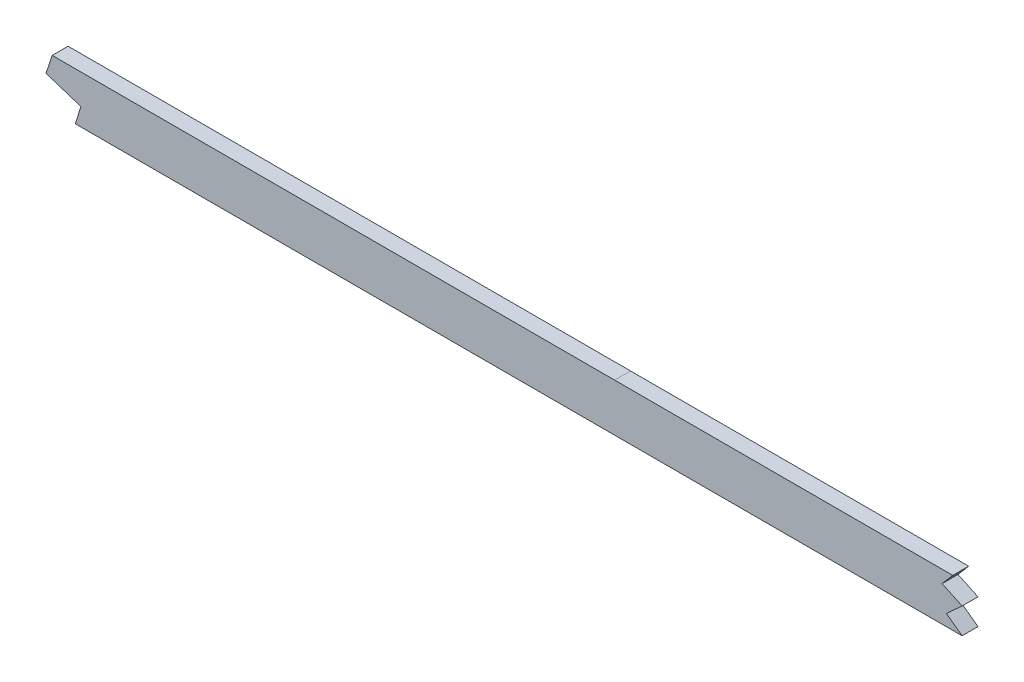
ISO-10303-21;
HEADER;
FILE_DESCRIPTION(('STEP AP214'),'2;1');
FILE_NAME('part.step','',(''),(''),'','','');
FILE_SCHEMA(('AUTOMOTIVE_DESIGN { 1 0 10303 214 1 1 1 1 }'));
ENDSEC;
DATA;
#1=APPLICATION_CONTEXT('core data for automotive mechanical design processes');
#2=APPLICATION_PROTOCOL_DEFINITION('international standard','automotive_design',2000,#1);
#3=PRODUCT_CONTEXT('',#1,'mechanical');
#4=PRODUCT('Part','Part','',(#3));
#5=PRODUCT_RELATED_PRODUCT_CATEGORY('part','',(#4));
#6=PRODUCT_DEFINITION_FORMATION('','',#4);
#7=PRODUCT_DEFINITION_CONTEXT('part definition',#1,'design');
#8=PRODUCT_DEFINITION('design','',#6,#7);
#9=PRODUCT_DEFINITION_SHAPE('','',#8);
#10=(LENGTH_UNIT() NAMED_UNIT(*) SI_UNIT(.MILLI.,.METRE.));
#11=(NAMED_UNIT(*) PLANE_ANGLE_UNIT() SI_UNIT($,.RADIAN.));
#12=(NAMED_UNIT(*) SI_UNIT($,.STERADIAN.) SOLID_ANGLE_UNIT());
#13=UNCERTAINTY_MEASURE_WITH_UNIT(LENGTH_MEASURE(1.E-05),#10,'distance_accuracy_value','');
#14=(GEOMETRIC_REPRESENTATION_CONTEXT(3) GLOBAL_UNCERTAINTY_ASSIGNED_CONTEXT((#13)) GLOBAL_UNIT_ASSIGNED_CONTEXT((#10,
#11,#12)) REPRESENTATION_CONTEXT('',''));
#15=CARTESIAN_POINT('',(0.,0.,0.));
#16=DIRECTION('',(0.,0.,1.));
#17=DIRECTION('',(1.,0.,0.));
#18=AXIS2_PLACEMENT_3D('',#15,#16,#17);
#19=CARTESIAN_POINT('',(2698.48667469404,11.4806601503293,3.175));
#20=CARTESIAN_POINT('',(2691.24737670604,10.9833200828121,3.175));
#21=CARTESIAN_POINT('',(2679.19516047804,10.1655376868452,3.175));
#22=CARTESIAN_POINT('',(2662.27652557768,9.03876140898899,3.175));
#23=CARTESIAN_POINT('',(2635.66628230206,7.2924691456857,3.175));
#24=CARTESIAN_POINT('',(2596.85766552893,4.8260568530791,3.175));
#25=CARTESIAN_POINT('',(2545.72974303923,1.75834409257586,3.175));
#26=CARTESIAN_POINT('',(2494.40530570724,-1.09855523520035,3.175));
#27=CARTESIAN_POINT('',(2451.53302226734,-3.26657329681936,3.175));
#28=CARTESIAN_POINT('',(2417.1983167563,-4.86708361008882,3.175));
#29=CARTESIAN_POINT('',(2391.45707691927,-6.00358923536048,3.175));
#30=CARTESIAN_POINT('',(2365.63473630713,-7.08685458139135,3.175));
#31=CARTESIAN_POINT('',(2339.54628467245,-8.13772994402807,3.175));
#32=CARTESIAN_POINT('',(2313.46613297408,-9.16513837136649,3.175));
#33=CARTESIAN_POINT('',(2287.61237548634,-10.1794782148021,3.175));
#34=CARTESIAN_POINT('',(2261.7633474368,-11.2010322967668,3.175));
#35=CARTESIAN_POINT('',(2227.28532971514,-12.5838425566113,3.175));
#36=CARTESIAN_POINT('',(2184.17556939327,-14.3660723604172,3.175));
#37=CARTESIAN_POINT('',(2132.42906611447,-16.6074278682384,3.175));
#38=CARTESIAN_POINT('',(2063.42552339989,-19.708920484548,3.175));
#39=CARTESIAN_POINT('',(1977.17490763451,-23.7005433130483,3.175));
#40=CARTESIAN_POINT('',(1873.73245143151,-28.149389220677,3.175));
#41=CARTESIAN_POINT('',(1770.37461881016,-31.6574686487852,3.175));
#42=CARTESIAN_POINT('',(1667.08568781321,-33.7931175563218,3.175));
#43=CARTESIAN_POINT('',(1581.01109449057,-34.3831888311612,3.175));
#44=CARTESIAN_POINT('',(1512.07397125959,-34.4278026003723,3.175));
#45=CARTESIAN_POINT('',(1443.06151347714,-34.4095104024296,3.175));
#46=CARTESIAN_POINT('',(1356.80092787913,-34.4244328117572,3.175));
#47=CARTESIAN_POINT('',(1218.79462695393,-34.4184647879491,3.175));
#48=CARTESIAN_POINT('',(1115.28902278569,-34.4207027968771,3.175));
#49=CARTESIAN_POINT('',(1046.28548189005,-34.4207027968771,3.175));
#50=B_SPLINE_CURVE_WITH_KNOTS('',3,(#19,#20,#21,#22,#23,#24,#25,#26,#27,#28,#29,#30,#31,#32,#33,
#34,#35,#36,#37,#38,#39,#40,#41,#42,#43,#44,#45,#46,#47,#48,#49),.UNSPECIFIED.,.F.,.F.,(4,1,1,1,
1,1,1,1,1,1,1,1,1,1,1,1,1,1,1,1,1,1,1,1,1,1,1,1,4),(100.654804519159,102.842388131745,
104.300777206802,105.766098402935,110.877392286712,115.988686170488,121.099980054264,
126.21127393804,128.766920879929,131.322567821817,133.878214763705,136.433861705593,
138.989508647481,141.545155589369,144.100802531257,146.656449473146,151.767743356922,
156.879037240698,161.990331124474,172.212918892027,182.43550665958,192.658094427132,
202.880682194685,213.103269962237,218.214563846014,223.32585772979,233.548445497342,
243.771033264895,264.2162088),.UNSPECIFIED.);
#51=DIRECTION('',(0.,0.,-1.));
#52=VECTOR('',#51,1.);
#53=SURFACE_OF_LINEAR_EXTRUSION('',#50,#52);
#54=CARTESIAN_POINT('',(1181.43398343302,-34.4200405248928,3.175));
#55=VERTEX_POINT('',#54);
#56=CARTESIAN_POINT('',(1046.28548189005,-34.4207027968771,3.175));
#57=VERTEX_POINT('',#56);
#58=EDGE_CURVE('E42',#55,#57,#50,.T.);
#59=ORIENTED_EDGE('',*,*,#58,.F.);
#60=DIRECTION('',(0.,0.,1.));
#61=VECTOR('',#60,1.);
#62=CARTESIAN_POINT('',(1181.43398343302,-34.4200405248928,-4.445));
#63=LINE('',#62,#61);
#64=CARTESIAN_POINT('',(1181.43398343302,-34.4200405248928,-3.175));
#65=VERTEX_POINT('',#64);
#66=EDGE_CURVE('E161',#65,#55,#63,.T.);
#67=ORIENTED_EDGE('',*,*,#66,.F.);
#68=CARTESIAN_POINT('',(2698.48667469404,11.4806601503293,-3.175));
#69=CARTESIAN_POINT('',(2691.24737670604,10.9833200828121,-3.175));
#70=CARTESIAN_POINT('',(2679.19516047804,10.1655376868452,-3.175));
#71=CARTESIAN_POINT('',(2662.27652557768,9.03876140898899,-3.175));
#72=CARTESIAN_POINT('',(2635.66628230206,7.2924691456857,-3.175));
#73=CARTESIAN_POINT('',(2596.85766552893,4.8260568530791,-3.175));
#74=CARTESIAN_POINT('',(2545.72974303923,1.75834409257586,-3.175));
#75=CARTESIAN_POINT('',(2494.40530570724,-1.09855523520035,-3.175));
#76=CARTESIAN_POINT('',(2451.53302226734,-3.26657329681936,-3.175));
#77=CARTESIAN_POINT('',(2417.1983167563,-4.86708361008882,-3.175));
#78=CARTESIAN_POINT('',(2391.45707691927,-6.00358923536048,-3.175));
#79=CARTESIAN_POINT('',(2365.63473630713,-7.08685458139135,-3.175));
#80=CARTESIAN_POINT('',(2339.54628467245,-8.13772994402807,-3.175));
#81=CARTESIAN_POINT('',(2313.46613297408,-9.16513837136649,-3.175));
#82=CARTESIAN_POINT('',(2287.61237548634,-10.1794782148021,-3.175));
#83=CARTESIAN_POINT('',(2261.7633474368,-11.2010322967668,-3.175));
#84=CARTESIAN_POINT('',(2227.28532971514,-12.5838425566113,-3.175));
#85=CARTESIAN_POINT('',(2184.17556939327,-14.3660723604172,-3.175));
#86=CARTESIAN_POINT('',(2132.42906611447,-16.6074278682384,-3.175));
#87=CARTESIAN_POINT('',(2063.42552339989,-19.708920484548,-3.175));
#88=CARTESIAN_POINT('',(1977.17490763451,-23.7005433130483,-3.175));
#89=CARTESIAN_POINT('',(1873.73245143151,-28.149389220677,-3.175));
#90=CARTESIAN_POINT('',(1770.37461881016,-31.6574686487852,-3.175));
#91=CARTESIAN_POINT('',(1667.08568781321,-33.7931175563218,-3.175));
#92=CARTESIAN_POINT('',(1581.01109449057,-34.3831888311612,-3.175));
#93=CARTESIAN_POINT('',(1512.07397125959,-34.4278026003723,-3.175));
#94=CARTESIAN_POINT('',(1443.06151347714,-34.4095104024296,-3.175));
#95=CARTESIAN_POINT('',(1356.80092787913,-34.4244328117572,-3.175));
#96=CARTESIAN_POINT('',(1218.79462695393,-34.4184647879491,-3.175));
#97=CARTESIAN_POINT('',(1115.28902278569,-34.4207027968771,-3.175));
#98=CARTESIAN_POINT('',(1046.28548189005,-34.4207027968771,-3.175));
#99=B_SPLINE_CURVE_WITH_KNOTS('',3,(#68,#69,#70,#71,#72,#73,#74,#75,#76,#77,#78,#79,#80,#81,#82,
#83,#84,#85,#86,#87,#88,#89,#90,#91,#92,#93,#94,#95,#96,#97,#98),.UNSPECIFIED.,.F.,.F.,(4,1,1,1,
1,1,1,1,1,1,1,1,1,1,1,1,1,1,1,1,1,1,1,1,1,1,1,1,4),(100.654804519159,102.842388131745,
104.300777206802,105.766098402935,110.877392286712,115.988686170488,121.099980054264,
126.21127393804,128.766920879929,131.322567821817,133.878214763705,136.433861705593,
138.989508647481,141.545155589369,144.100802531257,146.656449473146,151.767743356922,
156.879037240698,161.990331124474,172.212918892027,182.43550665958,192.658094427132,
202.880682194685,213.103269962237,218.214563846014,223.32585772979,233.548445497342,
243.771033264895,264.2162088),.UNSPECIFIED.);
#100=CARTESIAN_POINT('',(1046.28548189005,-34.4207027968771,-3.175));
#101=VERTEX_POINT('',#100);
#102=EDGE_CURVE('E158',#65,#101,#99,.T.);
#103=ORIENTED_EDGE('',*,*,#102,.T.);
#104=DIRECTION('',(0.,0.,-1.));
#105=VECTOR('',#104,1.);
#106=CARTESIAN_POINT('',(1046.28548189005,-34.4207027968771,3.175));
#107=LINE('',#106,#105);
#108=EDGE_CURVE('E270',#57,#101,#107,.T.);
#109=ORIENTED_EDGE('',*,*,#108,.F.);
#110=EDGE_LOOP('',(#59,#67,#103,#109));
#111=FACE_BOUND('',#110,.T.);
#112=ADVANCED_FACE('F38',(#111),#53,.F.);
#113=CARTESIAN_POINT('',(0.,-53.4707027968771,3.175));
#114=DIRECTION('',(0.,-1.,0.));
#115=DIRECTION('',(0.,0.,-1.));
#116=AXIS2_PLACEMENT_3D('',#113,#114,#115);
#117=PLANE('',#116);
#118=DIRECTION('',(0.,0.,1.));
#119=VECTOR('',#118,1.);
#120=CARTESIAN_POINT('',(830.756310041553,-53.4707027968771,-4.445));
#121=LINE('',#120,#119);
#122=CARTESIAN_POINT('',(830.756310041553,-53.4707027968771,-3.175));
#123=VERTEX_POINT('',#122);
#124=CARTESIAN_POINT('',(830.756310041553,-53.4707027968771,3.175));
#125=VERTEX_POINT('',#124);
#126=EDGE_CURVE('E122',#123,#125,#121,.T.);
#127=ORIENTED_EDGE('',*,*,#126,.F.);
#128=DIRECTION('',(-1.,0.,0.));
#129=VECTOR('',#128,1.);
#130=CARTESIAN_POINT('',(0.,-53.4707027968771,-3.175));
#131=LINE('',#130,#129);
#132=CARTESIAN_POINT('',(1046.28548189005,-53.4707027968771,-3.175));
#133=VERTEX_POINT('',#132);
#134=EDGE_CURVE('E232',#133,#123,#131,.T.);
#135=ORIENTED_EDGE('',*,*,#134,.F.);
#136=DIRECTION('',(0.,0.,-1.));
#137=VECTOR('',#136,1.);
#138=CARTESIAN_POINT('',(1046.28548189005,-53.4707027968771,3.175));
#139=LINE('',#138,#137);
#140=CARTESIAN_POINT('',(1046.28548189005,-53.4707027968771,3.175));
#141=VERTEX_POINT('',#140);
#142=EDGE_CURVE('E149',#141,#133,#139,.T.);
#143=ORIENTED_EDGE('',*,*,#142,.F.);
#144=DIRECTION('',(-1.,0.,0.));
#145=VECTOR('',#144,1.);
#146=CARTESIAN_POINT('',(0.,-53.4707027968771,3.175));
#147=LINE('',#146,#145);
#148=EDGE_CURVE('E141',#141,#125,#147,.T.);
#149=ORIENTED_EDGE('',*,*,#148,.T.);
#150=EDGE_LOOP('',(#127,#135,#143,#149));
#151=FACE_BOUND('',#150,.T.);
#152=ADVANCED_FACE('F40',(#151),#117,.T.);
#153=CARTESIAN_POINT('',(2699.79233294449,-7.52454325644929,3.175));
#154=CARTESIAN_POINT('',(2639.63682069028,-11.6572294058032,3.175));
#155=CARTESIAN_POINT('',(2579.48130742255,-15.435846921513,3.175));
#156=CARTESIAN_POINT('',(2518.49810546626,-19.1485286488731,3.175));
#157=CARTESIAN_POINT('',(2436.3555443117,-23.2523639114786,3.175));
#158=CARTESIAN_POINT('',(2354.21298315715,-26.6314864233564,3.175));
#159=CARTESIAN_POINT('',(2332.5703304682,-27.4809881692809,3.175));
#160=CARTESIAN_POINT('',(2156.26863942885,-34.3777685431634,3.175));
#161=CARTESIAN_POINT('',(1979.96694737597,-41.6286312484567,3.175));
#162=CARTESIAN_POINT('',(1824.11427763497,-52.7712658766203,3.175));
#163=CARTESIAN_POINT('',(1636.92860677809,-53.5795698486924,3.175));
#164=CARTESIAN_POINT('',(1449.7429359212,-53.4540246131279,3.175));
#165=CARTESIAN_POINT('',(1418.00673093479,-53.4707027968771,3.175));
#166=CARTESIAN_POINT('',(1324.89933614602,-53.4707027968771,3.175));
#167=CARTESIAN_POINT('',(1231.79194034372,-53.4707027968771,3.175));
#168=CARTESIAN_POINT('',(1170.4412693194,-53.4707027968771,3.175));
#169=CARTESIAN_POINT('',(1108.78407581299,-53.4707027968771,3.175));
#170=CARTESIAN_POINT('',(1047.12688234629,-53.4707027968771,3.175));
#171=CARTESIAN_POINT('',(1046.84641418849,-53.4707027968771,3.175));
#172=CARTESIAN_POINT('',(1046.56594718406,-53.4707027968771,3.175));
#173=CARTESIAN_POINT('',(1046.28548189005,-53.4707027968771,3.175));
#174=(BOUNDED_CURVE() B_SPLINE_CURVE(5,(#153,#154,#155,#156,#157,#158,#159,#160,#161,#162,#163,
#164,#165,#166,#167,#168,#169,#170,#171,#172,#173),.UNSPECIFIED.,.F.,
.F.) B_SPLINE_CURVE_WITH_KNOTS((6,3,3,3,3,3,6),(100.654804519159,130.927896619159,
141.337054719159,218.101815019159,233.772059419159,264.077723219159,264.2162088),
.UNSPECIFIED.) CURVE() GEOMETRIC_REPRESENTATION_ITEM() RATIONAL_B_SPLINE_CURVE((1.,1.,1.,1.,1.,
1.,1.,1.,1.,1.,1.,1.,1.,1.,1.,1.,1.,1.,1.,1.,1.)) REPRESENTATION_ITEM(''));
#175=DIRECTION('',(0.,0.,-1.));
#176=VECTOR('',#175,1.);
#177=SURFACE_OF_LINEAR_EXTRUSION('',#174,#176);
#178=DIRECTION('',(0.,0.,1.));
#179=VECTOR('',#178,1.);
#180=CARTESIAN_POINT('',(1185.13596806479,-53.4707027968771,-4.445));
#181=LINE('',#180,#179);
#182=CARTESIAN_POINT('',(1185.13596806479,-53.4707027968771,-3.175));
#183=VERTEX_POINT('',#182);
#184=CARTESIAN_POINT('',(1185.13596806479,-53.4707027968771,3.175));
#185=VERTEX_POINT('',#184);
#186=EDGE_CURVE('E145',#183,#185,#181,.T.);
#187=ORIENTED_EDGE('',*,*,#186,.T.);
#188=EDGE_CURVE('E151',#185,#141,#174,.T.);
#189=ORIENTED_EDGE('',*,*,#188,.T.);
#190=ORIENTED_EDGE('',*,*,#142,.T.);
#191=CARTESIAN_POINT('',(2699.79233294449,-7.52454325644929,-3.175));
#192=CARTESIAN_POINT('',(2639.63682069028,-11.6572294058032,-3.175));
#193=CARTESIAN_POINT('',(2579.48130742255,-15.435846921513,-3.175));
#194=CARTESIAN_POINT('',(2518.49810546626,-19.1485286488731,-3.175));
#195=CARTESIAN_POINT('',(2436.3555443117,-23.2523639114786,-3.175));
#196=CARTESIAN_POINT('',(2354.21298315715,-26.6314864233564,-3.175));
#197=CARTESIAN_POINT('',(2332.5703304682,-27.4809881692809,-3.175));
#198=CARTESIAN_POINT('',(2156.26863942885,-34.3777685431634,-3.175));
#199=CARTESIAN_POINT('',(1979.96694737597,-41.6286312484567,-3.175));
#200=CARTESIAN_POINT('',(1824.11427763497,-52.7712658766203,-3.175));
#201=CARTESIAN_POINT('',(1636.92860677809,-53.5795698486924,-3.175));
#202=CARTESIAN_POINT('',(1449.7429359212,-53.4540246131279,-3.175));
#203=CARTESIAN_POINT('',(1418.00673093479,-53.4707027968771,-3.175));
#204=CARTESIAN_POINT('',(1324.89933614602,-53.4707027968771,-3.175));
#205=CARTESIAN_POINT('',(1231.79194034372,-53.4707027968771,-3.175));
#206=CARTESIAN_POINT('',(1170.4412693194,-53.4707027968771,-3.175));
#207=CARTESIAN_POINT('',(1108.78407581299,-53.4707027968771,-3.175));
#208=CARTESIAN_POINT('',(1047.12688234629,-53.4707027968771,-3.175));
#209=CARTESIAN_POINT('',(1046.84641418849,-53.4707027968771,-3.175));
#210=CARTESIAN_POINT('',(1046.56594718406,-53.4707027968771,-3.175));
#211=CARTESIAN_POINT('',(1046.28548189005,-53.4707027968771,-3.175));
#212=(BOUNDED_CURVE() B_SPLINE_CURVE(5,(#191,#192,#193,#194,#195,#196,#197,#198,#199,#200,#201,
#202,#203,#204,#205,#206,#207,#208,#209,#210,#211),.UNSPECIFIED.,.F.,
.F.) B_SPLINE_CURVE_WITH_KNOTS((6,3,3,3,3,3,6),(100.654804519159,130.927896619159,
141.337054719159,218.101815019159,233.772059419159,264.077723219159,264.2162088),
.UNSPECIFIED.) CURVE() GEOMETRIC_REPRESENTATION_ITEM() RATIONAL_B_SPLINE_CURVE((1.,1.,1.,1.,1.,
1.,1.,1.,1.,1.,1.,1.,1.,1.,1.,1.,1.,1.,1.,1.,1.)) REPRESENTATION_ITEM(''));
#213=EDGE_CURVE('E278',#183,#133,#212,.T.);
#214=ORIENTED_EDGE('',*,*,#213,.F.);
#215=EDGE_LOOP('',(#187,#189,#190,#214));
#216=FACE_BOUND('',#215,.T.);
#217=ADVANCED_FACE('F173',(#216),#177,.T.);
#218=CARTESIAN_POINT('',(0.,-34.4207027968772,3.175));
#219=DIRECTION('',(0.,-1.,0.));
#220=DIRECTION('',(1.,0.,0.));
#221=AXIS2_PLACEMENT_3D('',#218,#219,#220);
#222=PLANE('',#221);
#223=DIRECTION('',(-1.,0.,0.));
#224=VECTOR('',#223,1.);
#225=CARTESIAN_POINT('',(0.,-34.4207027968772,-3.175));
#226=LINE('',#225,#224);
#227=CARTESIAN_POINT('',(821.518882755119,-34.4207027968771,-3.175));
#228=VERTEX_POINT('',#227);
#229=EDGE_CURVE('E152',#101,#228,#226,.T.);
#230=ORIENTED_EDGE('',*,*,#229,.T.);
#231=DIRECTION('',(0.,0.,1.));
#232=VECTOR('',#231,1.);
#233=CARTESIAN_POINT('',(821.518882755119,-34.4207027968771,-4.445));
#234=LINE('',#233,#232);
#235=CARTESIAN_POINT('',(821.518882755119,-34.4207027968771,3.175));
#236=VERTEX_POINT('',#235);
#237=EDGE_CURVE('E221',#228,#236,#234,.T.);
#238=ORIENTED_EDGE('',*,*,#237,.T.);
#239=DIRECTION('',(-1.,0.,0.));
#240=VECTOR('',#239,1.);
#241=CARTESIAN_POINT('',(0.,-34.4207027968772,3.175));
#242=LINE('',#241,#240);
#243=EDGE_CURVE('E227',#57,#236,#242,.T.);
#244=ORIENTED_EDGE('',*,*,#243,.F.);
#245=ORIENTED_EDGE('',*,*,#108,.T.);
#246=EDGE_LOOP('',(#230,#238,#244,#245));
#247=FACE_BOUND('',#246,.T.);
#248=ADVANCED_FACE('F176',(#247),#222,.F.);
#249=CARTESIAN_POINT('',(0.,0.,3.175));
#250=DIRECTION('',(0.,0.,1.));
#251=DIRECTION('',(1.,0.,0.));
#252=AXIS2_PLACEMENT_3D('',#249,#250,#251);
#253=PLANE('',#252);
#254=DIRECTION('',(0.314735447377986,0.949179434123906,0.));
#255=VECTOR('',#254,1.);
#256=CARTESIAN_POINT('',(821.518882755119,-34.4207027968771,3.175));
#257=LINE('',#256,#255);
#258=CARTESIAN_POINT('',(819.047328197418,-41.8744191673383,3.175));
#259=VERTEX_POINT('',#258);
#260=EDGE_CURVE('E134',#259,#236,#257,.T.);
#261=ORIENTED_EDGE('',*,*,#260,.F.);
#262=DIRECTION('',(-0.951561635426516,0.30745805239807,0.));
#263=VECTOR('',#262,1.);
#264=CARTESIAN_POINT('',(819.047328197418,-41.8744191673383,3.175));
#265=LINE('',#264,#263);
#266=CARTESIAN_POINT('',(833.004793215906,-46.3842006163091,3.175));
#267=VERTEX_POINT('',#266);
#268=EDGE_CURVE('E143',#267,#259,#265,.T.);
#269=ORIENTED_EDGE('',*,*,#268,.F.);
#270=DIRECTION('',(0.302432493069435,0.953170806904936,0.));
#271=VECTOR('',#270,1.);
#272=CARTESIAN_POINT('',(833.004793215906,-46.3842006163091,3.175));
#273=LINE('',#272,#271);
#274=EDGE_CURVE('E125',#125,#267,#273,.T.);
#275=ORIENTED_EDGE('',*,*,#274,.F.);
#276=ORIENTED_EDGE('',*,*,#148,.F.);
#277=ORIENTED_EDGE('',*,*,#188,.F.);
#278=DIRECTION('',(0.807160024463634,-0.59033269849117,0.));
#279=VECTOR('',#278,1.);
#280=CARTESIAN_POINT('',(1178.85783852763,-48.8790666419403,3.175));
#281=LINE('',#280,#279);
#282=CARTESIAN_POINT('',(1178.85783852763,-48.8790666419403,3.175));
#283=VERTEX_POINT('',#282);
#284=EDGE_CURVE('E247',#283,#185,#281,.T.);
#285=ORIENTED_EDGE('',*,*,#284,.F.);
#286=DIRECTION('',(-0.73933586722595,-0.673336821682323,0.));
#287=VECTOR('',#286,1.);
#288=CARTESIAN_POINT('',(1185.13596806479,-43.1613732686698,3.175));
#289=LINE('',#288,#287);
#290=CARTESIAN_POINT('',(1185.13596806479,-43.1613732686698,3.175));
#291=VERTEX_POINT('',#290);
#292=EDGE_CURVE('E243',#291,#283,#289,.T.);
#293=ORIENTED_EDGE('',*,*,#292,.F.);
#294=DIRECTION('',(0.905436783134564,-0.424481132380383,0.));
#295=VECTOR('',#294,1.);
#296=CARTESIAN_POINT('',(1177.13638245826,-39.4110582603955,3.175));
#297=LINE('',#296,#295);
#298=CARTESIAN_POINT('',(1177.13638245826,-39.4110582603955,3.175));
#299=VERTEX_POINT('',#298);
#300=EDGE_CURVE('E239',#299,#291,#297,.T.);
#301=ORIENTED_EDGE('',*,*,#300,.F.);
#302=DIRECTION('',(-0.652503967761315,-0.757785307363333,0.));
#303=VECTOR('',#302,1.);
#304=CARTESIAN_POINT('',(1181.43398343302,-34.4200405248928,3.175));
#305=LINE('',#304,#303);
#306=EDGE_CURVE('E236',#55,#299,#305,.T.);
#307=ORIENTED_EDGE('',*,*,#306,.F.);
#308=ORIENTED_EDGE('',*,*,#58,.T.);
#309=ORIENTED_EDGE('',*,*,#243,.T.);
#310=EDGE_LOOP('',(#261,#269,#275,#276,#277,#285,#293,#301,#307,#308,#309));
#311=FACE_BOUND('',#310,.T.);
#312=ADVANCED_FACE('F139',(#311),#253,.T.);
#313=CARTESIAN_POINT('',(0.,0.,-3.175));
#314=DIRECTION('',(0.,0.,1.));
#315=DIRECTION('',(1.,0.,0.));
#316=AXIS2_PLACEMENT_3D('',#313,#314,#315);
#317=PLANE('',#316);
#318=DIRECTION('',(-0.951561635426516,0.30745805239807,0.));
#319=VECTOR('',#318,1.);
#320=CARTESIAN_POINT('',(65.1739143006651,201.708805462653,-3.175));
#321=LINE('',#320,#319);
#322=CARTESIAN_POINT('',(833.004793215906,-46.3842006163091,-3.175));
#323=VERTEX_POINT('',#322);
#324=CARTESIAN_POINT('',(819.047328197418,-41.8744191673383,-3.175));
#325=VERTEX_POINT('',#324);
#326=EDGE_CURVE('E49',#323,#325,#321,.T.);
#327=ORIENTED_EDGE('',*,*,#326,.T.);
#328=DIRECTION('',(0.314735447377986,0.949179434123907,0.));
#329=VECTOR('',#328,1.);
#330=CARTESIAN_POINT('',(750.423390149356,-248.830550821575,-3.175));
#331=LINE('',#330,#329);
#332=EDGE_CURVE('E11',#325,#228,#331,.T.);
#333=ORIENTED_EDGE('',*,*,#332,.T.);
#334=ORIENTED_EDGE('',*,*,#229,.F.);
#335=ORIENTED_EDGE('',*,*,#102,.F.);
#336=DIRECTION('',(-0.652503967761315,-0.757785307363333,0.));
#337=VECTOR('',#336,1.);
#338=CARTESIAN_POINT('',(695.444225260897,-598.824115392695,-3.175));
#339=LINE('',#338,#337);
#340=CARTESIAN_POINT('',(1177.13638245826,-39.4110582603955,-3.175));
#341=VERTEX_POINT('',#340);
#342=EDGE_CURVE('E264',#65,#341,#339,.T.);
#343=ORIENTED_EDGE('',*,*,#342,.T.);
#344=DIRECTION('',(0.905436783134564,-0.424481132380383,0.));
#345=VECTOR('',#344,1.);
#346=CARTESIAN_POINT('',(196.954135852065,420.111768433416,-3.175));
#347=LINE('',#346,#345);
#348=CARTESIAN_POINT('',(1185.13596806479,-43.1613732686698,-3.175));
#349=VERTEX_POINT('',#348);
#350=EDGE_CURVE('E298',#341,#349,#347,.T.);
#351=ORIENTED_EDGE('',*,*,#350,.T.);
#352=DIRECTION('',(-0.73933586722595,-0.673336821682323,0.));
#353=VECTOR('',#352,1.);
#354=CARTESIAN_POINT('',(558.806562808448,-613.579595563031,-3.175));
#355=LINE('',#354,#353);
#356=CARTESIAN_POINT('',(1178.85783852763,-48.8790666419403,-3.175));
#357=VERTEX_POINT('',#356);
#358=EDGE_CURVE('E302',#349,#357,#355,.T.);
#359=ORIENTED_EDGE('',*,*,#358,.T.);
#360=DIRECTION('',(0.807160024463634,-0.59033269849117,0.));
#361=VECTOR('',#360,1.);
#362=CARTESIAN_POINT('',(387.532814142506,529.872386441092,-3.175));
#363=LINE('',#362,#361);
#364=EDGE_CURVE('E306',#357,#183,#363,.T.);
#365=ORIENTED_EDGE('',*,*,#364,.T.);
#366=ORIENTED_EDGE('',*,*,#213,.T.);
#367=ORIENTED_EDGE('',*,*,#134,.T.);
#368=DIRECTION('',(0.302432493069435,0.953170806904936,0.));
#369=VECTOR('',#368,1.);
#370=CARTESIAN_POINT('',(770.184831209246,-244.372694735819,-3.175));
#371=LINE('',#370,#369);
#372=EDGE_CURVE('E128',#123,#323,#371,.T.);
#373=ORIENTED_EDGE('',*,*,#372,.T.);
#374=EDGE_LOOP('',(#327,#333,#334,#335,#343,#351,#359,#365,#366,#367,#373));
#375=FACE_BOUND('',#374,.T.);
#376=ADVANCED_FACE('F184',(#375),#317,.F.);
#377=CARTESIAN_POINT('',(1178.85783852763,-48.8790666419403,-4.445));
#378=DIRECTION('',(-0.59033269849117,-0.807160024463634,0.));
#379=DIRECTION('',(0.807160024463634,-0.59033269849117,0.));
#380=AXIS2_PLACEMENT_3D('',#377,#378,#379);
#381=PLANE('',#380);
#382=DIRECTION('',(0.,0.,1.));
#383=VECTOR('',#382,1.);
#384=CARTESIAN_POINT('',(1178.85783852763,-48.8790666419403,-4.445));
#385=LINE('',#384,#383);
#386=EDGE_CURVE('E253',#357,#283,#385,.T.);
#387=ORIENTED_EDGE('',*,*,#386,.T.);
#388=ORIENTED_EDGE('',*,*,#284,.T.);
#389=ORIENTED_EDGE('',*,*,#186,.F.);
#390=ORIENTED_EDGE('',*,*,#364,.F.);
#391=EDGE_LOOP('',(#387,#388,#389,#390));
#392=FACE_BOUND('',#391,.T.);
#393=ADVANCED_FACE('F187',(#392),#381,.F.);
#394=CARTESIAN_POINT('',(1185.13596806479,-43.1613732686698,-4.445));
#395=DIRECTION('',(-0.673336821682323,0.73933586722595,0.));
#396=DIRECTION('',(-0.73933586722595,-0.673336821682323,0.));
#397=AXIS2_PLACEMENT_3D('',#394,#395,#396);
#398=PLANE('',#397);
#399=DIRECTION('',(0.,0.,1.));
#400=VECTOR('',#399,1.);
#401=CARTESIAN_POINT('',(1185.13596806479,-43.1613732686698,-4.445));
#402=LINE('',#401,#400);
#403=EDGE_CURVE('E256',#349,#291,#402,.T.);
#404=ORIENTED_EDGE('',*,*,#403,.T.);
#405=ORIENTED_EDGE('',*,*,#292,.T.);
#406=ORIENTED_EDGE('',*,*,#386,.F.);
#407=ORIENTED_EDGE('',*,*,#358,.F.);
#408=EDGE_LOOP('',(#404,#405,#406,#407));
#409=FACE_BOUND('',#408,.T.);
#410=ADVANCED_FACE('F198',(#409),#398,.F.);
#411=CARTESIAN_POINT('',(1177.13638245826,-39.4110582603955,-4.445));
#412=DIRECTION('',(-0.424481132380383,-0.905436783134564,0.));
#413=DIRECTION('',(0.905436783134564,-0.424481132380383,0.));
#414=AXIS2_PLACEMENT_3D('',#411,#412,#413);
#415=PLANE('',#414);
#416=DIRECTION('',(0.,0.,1.));
#417=VECTOR('',#416,1.);
#418=CARTESIAN_POINT('',(1177.13638245826,-39.4110582603955,-4.445));
#419=LINE('',#418,#417);
#420=EDGE_CURVE('E64',#341,#299,#419,.T.);
#421=ORIENTED_EDGE('',*,*,#420,.T.);
#422=ORIENTED_EDGE('',*,*,#300,.T.);
#423=ORIENTED_EDGE('',*,*,#403,.F.);
#424=ORIENTED_EDGE('',*,*,#350,.F.);
#425=EDGE_LOOP('',(#421,#422,#423,#424));
#426=FACE_BOUND('',#425,.T.);
#427=ADVANCED_FACE('F195',(#426),#415,.F.);
#428=CARTESIAN_POINT('',(1181.43398343302,-34.4200405248928,-4.445));
#429=DIRECTION('',(-0.757785307363333,0.652503967761315,0.));
#430=DIRECTION('',(-0.652503967761315,-0.757785307363333,0.));
#431=AXIS2_PLACEMENT_3D('',#428,#429,#430);
#432=PLANE('',#431);
#433=ORIENTED_EDGE('',*,*,#66,.T.);
#434=ORIENTED_EDGE('',*,*,#306,.T.);
#435=ORIENTED_EDGE('',*,*,#420,.F.);
#436=ORIENTED_EDGE('',*,*,#342,.F.);
#437=EDGE_LOOP('',(#433,#434,#435,#436));
#438=FACE_BOUND('',#437,.T.);
#439=ADVANCED_FACE('F191',(#438),#432,.F.);
#440=CARTESIAN_POINT('',(821.518882755119,-34.4207027968771,-4.445));
#441=DIRECTION('',(0.949179434123906,-0.314735447377986,0.));
#442=DIRECTION('',(0.314735447377986,0.949179434123907,0.));
#443=AXIS2_PLACEMENT_3D('',#440,#441,#442);
#444=PLANE('',#443);
#445=DIRECTION('',(0.,0.,1.));
#446=VECTOR('',#445,1.);
#447=CARTESIAN_POINT('',(819.047328197418,-41.8744191673383,-4.445));
#448=LINE('',#447,#446);
#449=EDGE_CURVE('E217',#325,#259,#448,.T.);
#450=ORIENTED_EDGE('',*,*,#449,.T.);
#451=ORIENTED_EDGE('',*,*,#260,.T.);
#452=ORIENTED_EDGE('',*,*,#237,.F.);
#453=ORIENTED_EDGE('',*,*,#332,.F.);
#454=EDGE_LOOP('',(#450,#451,#452,#453));
#455=FACE_BOUND('',#454,.T.);
#456=ADVANCED_FACE('F194',(#455),#444,.F.);
#457=CARTESIAN_POINT('',(819.047328197418,-41.8744191673383,-4.445));
#458=DIRECTION('',(0.30745805239807,0.951561635426516,0.));
#459=DIRECTION('',(-0.951561635426516,0.30745805239807,0.));
#460=AXIS2_PLACEMENT_3D('',#457,#458,#459);
#461=PLANE('',#460);
#462=DIRECTION('',(0.,0.,1.));
#463=VECTOR('',#462,1.);
#464=CARTESIAN_POINT('',(833.004793215906,-46.3842006163091,-4.445));
#465=LINE('',#464,#463);
#466=EDGE_CURVE('E56',#323,#267,#465,.T.);
#467=ORIENTED_EDGE('',*,*,#466,.T.);
#468=ORIENTED_EDGE('',*,*,#268,.T.);
#469=ORIENTED_EDGE('',*,*,#449,.F.);
#470=ORIENTED_EDGE('',*,*,#326,.F.);
#471=EDGE_LOOP('',(#467,#468,#469,#470));
#472=FACE_BOUND('',#471,.T.);
#473=ADVANCED_FACE('F208',(#472),#461,.F.);
#474=CARTESIAN_POINT('',(833.004793215906,-46.3842006163091,-4.445));
#475=DIRECTION('',(0.953170806904936,-0.302432493069435,0.));
#476=DIRECTION('',(0.302432493069435,0.953170806904936,0.));
#477=AXIS2_PLACEMENT_3D('',#474,#475,#476);
#478=PLANE('',#477);
#479=ORIENTED_EDGE('',*,*,#126,.T.);
#480=ORIENTED_EDGE('',*,*,#274,.T.);
#481=ORIENTED_EDGE('',*,*,#466,.F.);
#482=ORIENTED_EDGE('',*,*,#372,.F.);
#483=EDGE_LOOP('',(#479,#480,#481,#482));
#484=FACE_BOUND('',#483,.T.);
#485=ADVANCED_FACE('F124',(#484),#478,.F.);
#486=CLOSED_SHELL('',(#112,#152,#217,#248,#312,#376,#393,#410,#427,#439,#456,#473,#485));
#487=MANIFOLD_SOLID_BREP('B2',#486);
#488=ADVANCED_BREP_SHAPE_REPRESENTATION('',(#18,#487),#14);
#489=SHAPE_DEFINITION_REPRESENTATION(#9,#488);
ENDSEC;
END-ISO-10303-21;
